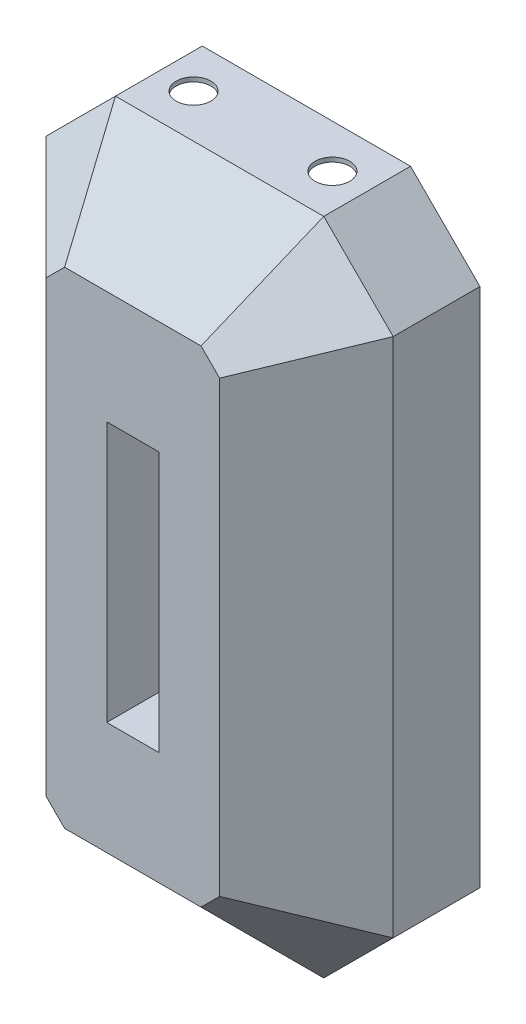
ISO-10303-21;
HEADER;
FILE_DESCRIPTION(('STEP AP214'),'2;1');
FILE_NAME('part.step','',(''),(''),'','','');
FILE_SCHEMA(('AUTOMOTIVE_DESIGN { 1 0 10303 214 1 1 1 1 }'));
ENDSEC;
DATA;
#1=APPLICATION_CONTEXT('core data for automotive mechanical design processes');
#2=APPLICATION_PROTOCOL_DEFINITION('international standard','automotive_design',2000,#1);
#3=PRODUCT_CONTEXT('',#1,'mechanical');
#4=PRODUCT('Part','Part','',(#3));
#5=PRODUCT_RELATED_PRODUCT_CATEGORY('part','',(#4));
#6=PRODUCT_DEFINITION_FORMATION('','',#4);
#7=PRODUCT_DEFINITION_CONTEXT('part definition',#1,'design');
#8=PRODUCT_DEFINITION('design','',#6,#7);
#9=PRODUCT_DEFINITION_SHAPE('','',#8);
#10=(LENGTH_UNIT() NAMED_UNIT(*) SI_UNIT(.MILLI.,.METRE.));
#11=(NAMED_UNIT(*) PLANE_ANGLE_UNIT() SI_UNIT($,.RADIAN.));
#12=(NAMED_UNIT(*) SI_UNIT($,.STERADIAN.) SOLID_ANGLE_UNIT());
#13=UNCERTAINTY_MEASURE_WITH_UNIT(LENGTH_MEASURE(1.E-05),#10,'distance_accuracy_value','');
#14=(GEOMETRIC_REPRESENTATION_CONTEXT(3) GLOBAL_UNCERTAINTY_ASSIGNED_CONTEXT((#13)) GLOBAL_UNIT_ASSIGNED_CONTEXT((#10,
#11,#12)) REPRESENTATION_CONTEXT('',''));
#15=CARTESIAN_POINT('',(0.,0.,0.));
#16=DIRECTION('',(0.,0.,1.));
#17=DIRECTION('',(1.,0.,0.));
#18=AXIS2_PLACEMENT_3D('',#15,#16,#17);
#19=CARTESIAN_POINT('',(0.,0.,254.));
#20=DIRECTION('',(0.,0.,-1.));
#21=DIRECTION('',(-1.,0.,0.));
#22=AXIS2_PLACEMENT_3D('',#19,#20,#21);
#23=PLANE('',#22);
#24=DIRECTION('',(-1.,0.,0.));
#25=VECTOR('',#24,1.);
#26=CARTESIAN_POINT('',(-38.1,190.5,254.));
#27=LINE('',#26,#25);
#28=CARTESIAN_POINT('',(38.1,190.5,254.));
#29=VERTEX_POINT('',#28);
#30=CARTESIAN_POINT('',(-38.1,190.5,254.));
#31=VERTEX_POINT('',#30);
#32=EDGE_CURVE('E218',#29,#31,#27,.T.);
#33=ORIENTED_EDGE('',*,*,#32,.F.);
#34=DIRECTION('',(0.,1.,0.));
#35=VECTOR('',#34,1.);
#36=CARTESIAN_POINT('',(38.1,190.5,254.));
#37=LINE('',#36,#35);
#38=CARTESIAN_POINT('',(38.1,-190.5,254.));
#39=VERTEX_POINT('',#38);
#40=EDGE_CURVE('E132',#39,#29,#37,.T.);
#41=ORIENTED_EDGE('',*,*,#40,.F.);
#42=DIRECTION('',(1.,0.,0.));
#43=VECTOR('',#42,1.);
#44=CARTESIAN_POINT('',(-38.1,-190.5,254.));
#45=LINE('',#44,#43);
#46=CARTESIAN_POINT('',(-38.1,-190.5,254.));
#47=VERTEX_POINT('',#46);
#48=EDGE_CURVE('E225',#47,#39,#45,.T.);
#49=ORIENTED_EDGE('',*,*,#48,.F.);
#50=DIRECTION('',(0.,-1.,0.));
#51=VECTOR('',#50,1.);
#52=CARTESIAN_POINT('',(-38.1,190.5,254.));
#53=LINE('',#52,#51);
#54=EDGE_CURVE('E208',#31,#47,#53,.T.);
#55=ORIENTED_EDGE('',*,*,#54,.F.);
#56=EDGE_LOOP('',(#33,#41,#49,#55));
#57=FACE_BOUND('',#56,.T.);
#58=DIRECTION('',(-0.707106781186548,-0.707106781186548,0.));
#59=VECTOR('',#58,1.);
#60=CARTESIAN_POINT('',(127.,-328.394877578617,254.));
#61=LINE('',#60,#59);
#62=CARTESIAN_POINT('',(127.,-328.394877578617,254.));
#63=VERTEX_POINT('',#62);
#64=CARTESIAN_POINT('',(99.794877578617,-355.6,254.));
#65=VERTEX_POINT('',#64);
#66=EDGE_CURVE('E558',#63,#65,#61,.T.);
#67=ORIENTED_EDGE('',*,*,#66,.F.);
#68=DIRECTION('',(0.,-1.,0.));
#69=VECTOR('',#68,1.);
#70=CARTESIAN_POINT('',(127.,328.394877578617,254.));
#71=LINE('',#70,#69);
#72=CARTESIAN_POINT('',(127.,328.394877578617,254.));
#73=VERTEX_POINT('',#72);
#74=EDGE_CURVE('E461',#73,#63,#71,.T.);
#75=ORIENTED_EDGE('',*,*,#74,.F.);
#76=DIRECTION('',(0.707106781186547,-0.707106781186548,0.));
#77=VECTOR('',#76,1.);
#78=CARTESIAN_POINT('',(99.7948775786169,355.6,254.));
#79=LINE('',#78,#77);
#80=CARTESIAN_POINT('',(99.7948775786169,355.6,254.));
#81=VERTEX_POINT('',#80);
#82=EDGE_CURVE('E286',#81,#73,#79,.T.);
#83=ORIENTED_EDGE('',*,*,#82,.F.);
#84=DIRECTION('',(1.,0.,0.));
#85=VECTOR('',#84,1.);
#86=CARTESIAN_POINT('',(-99.794877578617,355.6,254.));
#87=LINE('',#86,#85);
#88=CARTESIAN_POINT('',(-99.794877578617,355.6,254.));
#89=VERTEX_POINT('',#88);
#90=EDGE_CURVE('E300',#89,#81,#87,.T.);
#91=ORIENTED_EDGE('',*,*,#90,.F.);
#92=DIRECTION('',(0.707106781186548,0.707106781186548,0.));
#93=VECTOR('',#92,1.);
#94=CARTESIAN_POINT('',(-127.,328.394877578617,254.));
#95=LINE('',#94,#93);
#96=CARTESIAN_POINT('',(-127.,328.394877578617,254.));
#97=VERTEX_POINT('',#96);
#98=EDGE_CURVE('E585',#97,#89,#95,.T.);
#99=ORIENTED_EDGE('',*,*,#98,.F.);
#100=DIRECTION('',(0.,1.,0.));
#101=VECTOR('',#100,1.);
#102=CARTESIAN_POINT('',(-127.,-328.394877578617,254.));
#103=LINE('',#102,#101);
#104=CARTESIAN_POINT('',(-127.,-328.394877578617,254.));
#105=VERTEX_POINT('',#104);
#106=EDGE_CURVE('E562',#105,#97,#103,.T.);
#107=ORIENTED_EDGE('',*,*,#106,.F.);
#108=DIRECTION('',(-0.707106781186547,0.707106781186548,0.));
#109=VECTOR('',#108,1.);
#110=CARTESIAN_POINT('',(-99.7948775786169,-355.6,254.));
#111=LINE('',#110,#109);
#112=CARTESIAN_POINT('',(-99.7948775786169,-355.6,254.));
#113=VERTEX_POINT('',#112);
#114=EDGE_CURVE('E391',#113,#105,#111,.T.);
#115=ORIENTED_EDGE('',*,*,#114,.F.);
#116=DIRECTION('',(-1.,0.,0.));
#117=VECTOR('',#116,1.);
#118=CARTESIAN_POINT('',(99.794877578617,-355.6,254.));
#119=LINE('',#118,#117);
#120=EDGE_CURVE('E555',#65,#113,#119,.T.);
#121=ORIENTED_EDGE('',*,*,#120,.F.);
#122=EDGE_LOOP('',(#67,#75,#83,#91,#99,#107,#115,#121));
#123=FACE_BOUND('',#122,.T.);
#124=ADVANCED_FACE('F116',(#57,#123),#23,.F.);
#125=CARTESIAN_POINT('',(0.,0.,127.));
#126=DIRECTION('',(0.,0.,-1.));
#127=DIRECTION('',(-1.,0.,0.));
#128=AXIS2_PLACEMENT_3D('',#125,#126,#127);
#129=PLANE('',#128);
#130=DIRECTION('',(0.,-1.,0.));
#131=VECTOR('',#130,1.);
#132=CARTESIAN_POINT('',(38.1,0.,127.));
#133=LINE('',#132,#131);
#134=CARTESIAN_POINT('',(38.1,190.5,127.));
#135=VERTEX_POINT('',#134);
#136=CARTESIAN_POINT('',(38.1,-190.5,127.));
#137=VERTEX_POINT('',#136);
#138=EDGE_CURVE('E13',#135,#137,#133,.T.);
#139=ORIENTED_EDGE('',*,*,#138,.F.);
#140=DIRECTION('',(1.,0.,0.));
#141=VECTOR('',#140,1.);
#142=CARTESIAN_POINT('',(0.,190.5,127.));
#143=LINE('',#142,#141);
#144=CARTESIAN_POINT('',(-38.1,190.5,127.));
#145=VERTEX_POINT('',#144);
#146=EDGE_CURVE('E618',#145,#135,#143,.T.);
#147=ORIENTED_EDGE('',*,*,#146,.F.);
#148=DIRECTION('',(0.,1.,0.));
#149=VECTOR('',#148,1.);
#150=CARTESIAN_POINT('',(-38.1,0.,127.));
#151=LINE('',#150,#149);
#152=CARTESIAN_POINT('',(-38.1,-190.5,127.));
#153=VERTEX_POINT('',#152);
#154=EDGE_CURVE('E211',#153,#145,#151,.T.);
#155=ORIENTED_EDGE('',*,*,#154,.F.);
#156=DIRECTION('',(-1.,0.,0.));
#157=VECTOR('',#156,1.);
#158=CARTESIAN_POINT('',(0.,-190.5,127.));
#159=LINE('',#158,#157);
#160=EDGE_CURVE('E125',#137,#153,#159,.T.);
#161=ORIENTED_EDGE('',*,*,#160,.F.);
#162=EDGE_LOOP('',(#139,#147,#155,#161));
#163=FACE_BOUND('',#162,.T.);
#164=DIRECTION('',(-0.707106781186548,-0.707106781186547,0.));
#165=VECTOR('',#164,1.);
#166=CARTESIAN_POINT('',(254.,-381.,127.));
#167=LINE('',#166,#165);
#168=CARTESIAN_POINT('',(254.,-381.,127.));
#169=VERTEX_POINT('',#168);
#170=CARTESIAN_POINT('',(152.4,-482.6,127.));
#171=VERTEX_POINT('',#170);
#172=EDGE_CURVE('E235',#169,#171,#167,.T.);
#173=ORIENTED_EDGE('',*,*,#172,.T.);
#174=DIRECTION('',(-1.,0.,0.));
#175=VECTOR('',#174,1.);
#176=CARTESIAN_POINT('',(152.4,-482.6,127.));
#177=LINE('',#176,#175);
#178=CARTESIAN_POINT('',(-152.4,-482.6,127.));
#179=VERTEX_POINT('',#178);
#180=EDGE_CURVE('E432',#171,#179,#177,.T.);
#181=ORIENTED_EDGE('',*,*,#180,.T.);
#182=DIRECTION('',(-0.707106781186548,0.707106781186547,0.));
#183=VECTOR('',#182,1.);
#184=CARTESIAN_POINT('',(-152.4,-482.6,127.));
#185=LINE('',#184,#183);
#186=CARTESIAN_POINT('',(-254.,-381.,127.));
#187=VERTEX_POINT('',#186);
#188=EDGE_CURVE('E548',#179,#187,#185,.T.);
#189=ORIENTED_EDGE('',*,*,#188,.T.);
#190=DIRECTION('',(0.,1.,0.));
#191=VECTOR('',#190,1.);
#192=CARTESIAN_POINT('',(-254.,-381.,127.));
#193=LINE('',#192,#191);
#194=CARTESIAN_POINT('',(-254.,381.,127.));
#195=VERTEX_POINT('',#194);
#196=EDGE_CURVE('E360',#187,#195,#193,.T.);
#197=ORIENTED_EDGE('',*,*,#196,.T.);
#198=DIRECTION('',(0.707106781186548,0.707106781186547,0.));
#199=VECTOR('',#198,1.);
#200=CARTESIAN_POINT('',(-254.,381.,127.));
#201=LINE('',#200,#199);
#202=CARTESIAN_POINT('',(-152.4,482.6,127.));
#203=VERTEX_POINT('',#202);
#204=EDGE_CURVE('E341',#195,#203,#201,.T.);
#205=ORIENTED_EDGE('',*,*,#204,.T.);
#206=DIRECTION('',(1.,0.,0.));
#207=VECTOR('',#206,1.);
#208=CARTESIAN_POINT('',(-152.4,482.6,127.));
#209=LINE('',#208,#207);
#210=CARTESIAN_POINT('',(152.4,482.6,127.));
#211=VERTEX_POINT('',#210);
#212=EDGE_CURVE('E483',#203,#211,#209,.T.);
#213=ORIENTED_EDGE('',*,*,#212,.T.);
#214=DIRECTION('',(0.707106781186547,-0.707106781186548,0.));
#215=VECTOR('',#214,1.);
#216=CARTESIAN_POINT('',(152.4,482.6,127.));
#217=LINE('',#216,#215);
#218=CARTESIAN_POINT('',(254.,381.,127.));
#219=VERTEX_POINT('',#218);
#220=EDGE_CURVE('E471',#211,#219,#217,.T.);
#221=ORIENTED_EDGE('',*,*,#220,.T.);
#222=DIRECTION('',(0.,-1.,0.));
#223=VECTOR('',#222,1.);
#224=CARTESIAN_POINT('',(254.,381.,127.));
#225=LINE('',#224,#223);
#226=EDGE_CURVE('E245',#219,#169,#225,.T.);
#227=ORIENTED_EDGE('',*,*,#226,.T.);
#228=EDGE_LOOP('',(#173,#181,#189,#197,#205,#213,#221,#227));
#229=FACE_BOUND('',#228,.T.);
#230=ADVANCED_FACE('F485',(#163,#229),#129,.T.);
#231=CARTESIAN_POINT('',(0.,-304.8,304.8));
#232=DIRECTION('',(0.,-0.707106781186548,0.707106781186548));
#233=DIRECTION('',(0.,-0.707106781186548,-0.707106781186548));
#234=AXIS2_PLACEMENT_3D('',#231,#232,#233);
#235=PLANE('',#234);
#236=DIRECTION('',(-0.28108463771482,0.678598344545847,0.678598344545847));
#237=VECTOR('',#236,1.);
#238=CARTESIAN_POINT('',(152.4,-482.6,127.));
#239=LINE('',#238,#237);
#240=EDGE_CURVE('E424',#171,#65,#239,.T.);
#241=ORIENTED_EDGE('',*,*,#240,.T.);
#242=ORIENTED_EDGE('',*,*,#120,.T.);
#243=DIRECTION('',(0.28108463771482,0.678598344545847,0.678598344545847));
#244=VECTOR('',#243,1.);
#245=CARTESIAN_POINT('',(-152.4,-482.6,127.));
#246=LINE('',#245,#244);
#247=EDGE_CURVE('E415',#179,#113,#246,.T.);
#248=ORIENTED_EDGE('',*,*,#247,.F.);
#249=ORIENTED_EDGE('',*,*,#180,.F.);
#250=EDGE_LOOP('',(#241,#242,#248,#249));
#251=FACE_BOUND('',#250,.T.);
#252=ADVANCED_FACE('F406',(#251),#235,.T.);
#253=CARTESIAN_POINT('',(-203.651280605346,-203.651280605346,288.006403026729));
#254=DIRECTION('',(-0.5,-0.5,0.707106781186548));
#255=DIRECTION('',(0.816496580927726,0.,0.577350269189626));
#256=AXIS2_PLACEMENT_3D('',#253,#254,#255);
#257=PLANE('',#256);
#258=ORIENTED_EDGE('',*,*,#247,.T.);
#259=ORIENTED_EDGE('',*,*,#114,.T.);
#260=DIRECTION('',(0.678598344545847,0.28108463771482,0.678598344545847));
#261=VECTOR('',#260,1.);
#262=CARTESIAN_POINT('',(-254.,-381.,127.));
#263=LINE('',#262,#261);
#264=EDGE_CURVE('E353',#187,#105,#263,.T.);
#265=ORIENTED_EDGE('',*,*,#264,.F.);
#266=ORIENTED_EDGE('',*,*,#188,.F.);
#267=EDGE_LOOP('',(#258,#259,#265,#266));
#268=FACE_BOUND('',#267,.T.);
#269=ADVANCED_FACE('F397',(#268),#257,.T.);
#270=CARTESIAN_POINT('',(203.651280605346,-203.651280605346,288.006403026729));
#271=DIRECTION('',(0.5,-0.5,0.707106781186547));
#272=DIRECTION('',(0.816496580927726,0.,-0.577350269189626));
#273=AXIS2_PLACEMENT_3D('',#270,#271,#272);
#274=PLANE('',#273);
#275=DIRECTION('',(-0.678598344545847,0.281084637714819,0.678598344545847));
#276=VECTOR('',#275,1.);
#277=CARTESIAN_POINT('',(254.,-381.,127.));
#278=LINE('',#277,#276);
#279=EDGE_CURVE('E423',#169,#63,#278,.T.);
#280=ORIENTED_EDGE('',*,*,#279,.T.);
#281=ORIENTED_EDGE('',*,*,#66,.T.);
#282=ORIENTED_EDGE('',*,*,#240,.F.);
#283=ORIENTED_EDGE('',*,*,#172,.F.);
#284=EDGE_LOOP('',(#280,#281,#282,#283));
#285=FACE_BOUND('',#284,.T.);
#286=ADVANCED_FACE('F264',(#285),#274,.T.);
#287=CARTESIAN_POINT('',(190.5,0.,190.5));
#288=DIRECTION('',(0.707106781186547,0.,0.707106781186547));
#289=DIRECTION('',(0.707106781186548,0.,-0.707106781186548));
#290=AXIS2_PLACEMENT_3D('',#287,#288,#289);
#291=PLANE('',#290);
#292=DIRECTION('',(-0.678598344545847,-0.28108463771482,0.678598344545847));
#293=VECTOR('',#292,1.);
#294=CARTESIAN_POINT('',(254.,381.,127.));
#295=LINE('',#294,#293);
#296=EDGE_CURVE('E251',#219,#73,#295,.T.);
#297=ORIENTED_EDGE('',*,*,#296,.T.);
#298=ORIENTED_EDGE('',*,*,#74,.T.);
#299=ORIENTED_EDGE('',*,*,#279,.F.);
#300=ORIENTED_EDGE('',*,*,#226,.F.);
#301=EDGE_LOOP('',(#297,#298,#299,#300));
#302=FACE_BOUND('',#301,.T.);
#303=ADVANCED_FACE('F253',(#302),#291,.T.);
#304=CARTESIAN_POINT('',(203.651280605346,203.651280605346,288.006403026729));
#305=DIRECTION('',(0.5,0.5,0.707106781186547));
#306=DIRECTION('',(0.816496580927726,0.,-0.577350269189626));
#307=AXIS2_PLACEMENT_3D('',#304,#305,#306);
#308=PLANE('',#307);
#309=DIRECTION('',(-0.28108463771482,-0.678598344545847,0.678598344545847));
#310=VECTOR('',#309,1.);
#311=CARTESIAN_POINT('',(152.4,482.6,127.));
#312=LINE('',#311,#310);
#313=EDGE_CURVE('E333',#211,#81,#312,.T.);
#314=ORIENTED_EDGE('',*,*,#313,.T.);
#315=ORIENTED_EDGE('',*,*,#82,.T.);
#316=ORIENTED_EDGE('',*,*,#296,.F.);
#317=ORIENTED_EDGE('',*,*,#220,.F.);
#318=EDGE_LOOP('',(#314,#315,#316,#317));
#319=FACE_BOUND('',#318,.T.);
#320=ADVANCED_FACE('F263',(#319),#308,.T.);
#321=CARTESIAN_POINT('',(0.,304.8,304.8));
#322=DIRECTION('',(0.,0.707106781186548,0.707106781186548));
#323=DIRECTION('',(0.,-0.707106781186548,0.707106781186548));
#324=AXIS2_PLACEMENT_3D('',#321,#322,#323);
#325=PLANE('',#324);
#326=DIRECTION('',(0.28108463771482,-0.678598344545847,0.678598344545847));
#327=VECTOR('',#326,1.);
#328=CARTESIAN_POINT('',(-152.4,482.6,127.));
#329=LINE('',#328,#327);
#330=EDGE_CURVE('E324',#203,#89,#329,.T.);
#331=ORIENTED_EDGE('',*,*,#330,.T.);
#332=ORIENTED_EDGE('',*,*,#90,.T.);
#333=ORIENTED_EDGE('',*,*,#313,.F.);
#334=ORIENTED_EDGE('',*,*,#212,.F.);
#335=EDGE_LOOP('',(#331,#332,#333,#334));
#336=FACE_BOUND('',#335,.T.);
#337=ADVANCED_FACE('F306',(#336),#325,.T.);
#338=CARTESIAN_POINT('',(-203.651280605346,203.651280605346,288.006403026729));
#339=DIRECTION('',(-0.5,0.5,0.707106781186548));
#340=DIRECTION('',(0.816496580927726,0.,0.577350269189626));
#341=AXIS2_PLACEMENT_3D('',#338,#339,#340);
#342=PLANE('',#341);
#343=DIRECTION('',(0.678598344545848,-0.281084637714819,0.678598344545847));
#344=VECTOR('',#343,1.);
#345=CARTESIAN_POINT('',(-254.,381.,127.));
#346=LINE('',#345,#344);
#347=EDGE_CURVE('E332',#195,#97,#346,.T.);
#348=ORIENTED_EDGE('',*,*,#347,.T.);
#349=ORIENTED_EDGE('',*,*,#98,.T.);
#350=ORIENTED_EDGE('',*,*,#330,.F.);
#351=ORIENTED_EDGE('',*,*,#204,.F.);
#352=EDGE_LOOP('',(#348,#349,#350,#351));
#353=FACE_BOUND('',#352,.T.);
#354=ADVANCED_FACE('F315',(#353),#342,.T.);
#355=CARTESIAN_POINT('',(-190.5,0.,190.5));
#356=DIRECTION('',(-0.707106781186548,0.,0.707106781186548));
#357=DIRECTION('',(0.707106781186548,0.,0.707106781186548));
#358=AXIS2_PLACEMENT_3D('',#355,#356,#357);
#359=PLANE('',#358);
#360=ORIENTED_EDGE('',*,*,#264,.T.);
#361=ORIENTED_EDGE('',*,*,#106,.T.);
#362=ORIENTED_EDGE('',*,*,#347,.F.);
#363=ORIENTED_EDGE('',*,*,#196,.F.);
#364=EDGE_LOOP('',(#360,#361,#362,#363));
#365=FACE_BOUND('',#364,.T.);
#366=ADVANCED_FACE('F366',(#365),#359,.T.);
#367=CARTESIAN_POINT('',(38.1,190.5,0.));
#368=DIRECTION('',(1.,0.,0.));
#369=DIRECTION('',(0.,1.,0.));
#370=AXIS2_PLACEMENT_3D('',#367,#368,#369);
#371=PLANE('',#370);
#372=ORIENTED_EDGE('',*,*,#138,.T.);
#373=DIRECTION('',(0.,0.,1.));
#374=VECTOR('',#373,1.);
#375=CARTESIAN_POINT('',(38.1,-190.5,0.));
#376=LINE('',#375,#374);
#377=EDGE_CURVE('E232',#137,#39,#376,.T.);
#378=ORIENTED_EDGE('',*,*,#377,.T.);
#379=ORIENTED_EDGE('',*,*,#40,.T.);
#380=DIRECTION('',(0.,0.,1.));
#381=VECTOR('',#380,1.);
#382=CARTESIAN_POINT('',(38.1,190.5,0.));
#383=LINE('',#382,#381);
#384=EDGE_CURVE('E215',#135,#29,#383,.T.);
#385=ORIENTED_EDGE('',*,*,#384,.F.);
#386=EDGE_LOOP('',(#372,#378,#379,#385));
#387=FACE_BOUND('',#386,.T.);
#388=ADVANCED_FACE('F374',(#387),#371,.F.);
#389=CARTESIAN_POINT('',(-38.1,-190.5,0.));
#390=DIRECTION('',(0.,-1.,0.));
#391=DIRECTION('',(0.,0.,-1.));
#392=AXIS2_PLACEMENT_3D('',#389,#390,#391);
#393=PLANE('',#392);
#394=ORIENTED_EDGE('',*,*,#160,.T.);
#395=DIRECTION('',(0.,0.,1.));
#396=VECTOR('',#395,1.);
#397=CARTESIAN_POINT('',(-38.1,-190.5,0.));
#398=LINE('',#397,#396);
#399=EDGE_CURVE('E214',#153,#47,#398,.T.);
#400=ORIENTED_EDGE('',*,*,#399,.T.);
#401=ORIENTED_EDGE('',*,*,#48,.T.);
#402=ORIENTED_EDGE('',*,*,#377,.F.);
#403=EDGE_LOOP('',(#394,#400,#401,#402));
#404=FACE_BOUND('',#403,.T.);
#405=ADVANCED_FACE('F675',(#404),#393,.F.);
#406=CARTESIAN_POINT('',(-38.1,190.5,0.));
#407=DIRECTION('',(-1.,0.,0.));
#408=DIRECTION('',(0.,-1.,0.));
#409=AXIS2_PLACEMENT_3D('',#406,#407,#408);
#410=PLANE('',#409);
#411=ORIENTED_EDGE('',*,*,#154,.T.);
#412=DIRECTION('',(0.,0.,1.));
#413=VECTOR('',#412,1.);
#414=CARTESIAN_POINT('',(-38.1,190.5,0.));
#415=LINE('',#414,#413);
#416=EDGE_CURVE('E140',#145,#31,#415,.T.);
#417=ORIENTED_EDGE('',*,*,#416,.T.);
#418=ORIENTED_EDGE('',*,*,#54,.T.);
#419=ORIENTED_EDGE('',*,*,#399,.F.);
#420=EDGE_LOOP('',(#411,#417,#418,#419));
#421=FACE_BOUND('',#420,.T.);
#422=ADVANCED_FACE('F205',(#421),#410,.F.);
#423=CARTESIAN_POINT('',(-38.1,190.5,0.));
#424=DIRECTION('',(0.,1.,0.));
#425=DIRECTION('',(0.,0.,1.));
#426=AXIS2_PLACEMENT_3D('',#423,#424,#425);
#427=PLANE('',#426);
#428=ORIENTED_EDGE('',*,*,#146,.T.);
#429=ORIENTED_EDGE('',*,*,#384,.T.);
#430=ORIENTED_EDGE('',*,*,#32,.T.);
#431=ORIENTED_EDGE('',*,*,#416,.F.);
#432=EDGE_LOOP('',(#428,#429,#430,#431));
#433=FACE_BOUND('',#432,.T.);
#434=ADVANCED_FACE('F219',(#433),#427,.F.);
#435=CLOSED_SHELL('',(#124,#230,#252,#269,#286,#303,#320,#337,#354,#366,#388,#405,#422,#434));
#436=MANIFOLD_SOLID_BREP('B2',#435);
#437=CARTESIAN_POINT('',(-152.4,482.6,127.));
#438=DIRECTION('',(0.,1.,0.));
#439=DIRECTION('',(0.,0.,1.));
#440=AXIS2_PLACEMENT_3D('',#437,#438,#439);
#441=PLANE('',#440);
#442=CARTESIAN_POINT('',(101.6,482.6,63.5));
#443=DIRECTION('',(0.,1.,0.));
#444=DIRECTION('',(0.,0.,1.));
#445=AXIS2_PLACEMENT_3D('',#442,#443,#444);
#446=CIRCLE('',#445,25.4);
#447=CARTESIAN_POINT('',(101.6,482.6,88.9));
#448=VERTEX_POINT('',#447);
#449=EDGE_CURVE('E1172',#448,#448,#446,.T.);
#450=ORIENTED_EDGE('',*,*,#449,.F.);
#451=EDGE_LOOP('',(#450));
#452=FACE_BOUND('',#451,.T.);
#453=CARTESIAN_POINT('',(-101.6,482.6,63.5));
#454=DIRECTION('',(0.,1.,0.));
#455=DIRECTION('',(0.,0.,1.));
#456=AXIS2_PLACEMENT_3D('',#453,#454,#455);
#457=CIRCLE('',#456,25.4);
#458=CARTESIAN_POINT('',(-101.6,482.6,88.9));
#459=VERTEX_POINT('',#458);
#460=EDGE_CURVE('E1018',#459,#459,#457,.T.);
#461=ORIENTED_EDGE('',*,*,#460,.F.);
#462=EDGE_LOOP('',(#461));
#463=FACE_BOUND('',#462,.T.);
#464=DIRECTION('',(1.,0.,0.));
#465=VECTOR('',#464,1.);
#466=CARTESIAN_POINT('',(-152.4,482.6,0.));
#467=LINE('',#466,#465);
#468=CARTESIAN_POINT('',(-152.4,482.6,0.));
#469=VERTEX_POINT('',#468);
#470=CARTESIAN_POINT('',(152.4,482.6,0.));
#471=VERTEX_POINT('',#470);
#472=EDGE_CURVE('E1052',#469,#471,#467,.T.);
#473=ORIENTED_EDGE('',*,*,#472,.F.);
#474=DIRECTION('',(0.,0.,-1.));
#475=VECTOR('',#474,1.);
#476=CARTESIAN_POINT('',(-152.4,482.6,127.));
#477=LINE('',#476,#475);
#478=CARTESIAN_POINT('',(-152.4,482.6,127.));
#479=VERTEX_POINT('',#478);
#480=EDGE_CURVE('E114',#479,#469,#477,.T.);
#481=ORIENTED_EDGE('',*,*,#480,.F.);
#482=DIRECTION('',(1.,0.,0.));
#483=VECTOR('',#482,1.);
#484=CARTESIAN_POINT('',(-152.4,482.6,127.));
#485=LINE('',#484,#483);
#486=CARTESIAN_POINT('',(152.4,482.6,127.));
#487=VERTEX_POINT('',#486);
#488=EDGE_CURVE('E1064',#479,#487,#485,.T.);
#489=ORIENTED_EDGE('',*,*,#488,.T.);
#490=DIRECTION('',(0.,0.,-1.));
#491=VECTOR('',#490,1.);
#492=CARTESIAN_POINT('',(152.4,482.6,127.));
#493=LINE('',#492,#491);
#494=EDGE_CURVE('E884',#487,#471,#493,.T.);
#495=ORIENTED_EDGE('',*,*,#494,.T.);
#496=EDGE_LOOP('',(#473,#481,#489,#495));
#497=FACE_BOUND('',#496,.T.);
#498=ADVANCED_FACE('F881',(#452,#463,#497),#441,.T.);
#499=CARTESIAN_POINT('',(-152.4,482.6,127.));
#500=DIRECTION('',(0.707106781186547,-0.707106781186548,0.));
#501=DIRECTION('',(0.707106781186548,0.707106781186547,0.));
#502=AXIS2_PLACEMENT_3D('',#499,#500,#501);
#503=PLANE('',#502);
#504=DIRECTION('',(-0.707106781186548,-0.707106781186547,0.));
#505=VECTOR('',#504,1.);
#506=CARTESIAN_POINT('',(-152.4,482.6,0.));
#507=LINE('',#506,#505);
#508=CARTESIAN_POINT('',(-254.,381.,0.));
#509=VERTEX_POINT('',#508);
#510=EDGE_CURVE('E1068',#469,#509,#507,.T.);
#511=ORIENTED_EDGE('',*,*,#510,.T.);
#512=DIRECTION('',(0.,0.,-1.));
#513=VECTOR('',#512,1.);
#514=CARTESIAN_POINT('',(-254.,381.,127.));
#515=LINE('',#514,#513);
#516=CARTESIAN_POINT('',(-254.,381.,127.));
#517=VERTEX_POINT('',#516);
#518=EDGE_CURVE('E889',#517,#509,#515,.T.);
#519=ORIENTED_EDGE('',*,*,#518,.F.);
#520=DIRECTION('',(-0.707106781186548,-0.707106781186547,0.));
#521=VECTOR('',#520,1.);
#522=CARTESIAN_POINT('',(-152.4,482.6,127.));
#523=LINE('',#522,#521);
#524=EDGE_CURVE('E1083',#479,#517,#523,.T.);
#525=ORIENTED_EDGE('',*,*,#524,.F.);
#526=ORIENTED_EDGE('',*,*,#480,.T.);
#527=EDGE_LOOP('',(#511,#519,#525,#526));
#528=FACE_BOUND('',#527,.T.);
#529=ADVANCED_FACE('F1131',(#528),#503,.F.);
#530=CARTESIAN_POINT('',(-254.,381.,127.));
#531=DIRECTION('',(1.,0.,0.));
#532=DIRECTION('',(0.,1.,0.));
#533=AXIS2_PLACEMENT_3D('',#530,#531,#532);
#534=PLANE('',#533);
#535=DIRECTION('',(0.,-1.,0.));
#536=VECTOR('',#535,1.);
#537=CARTESIAN_POINT('',(-254.,381.,0.));
#538=LINE('',#537,#536);
#539=CARTESIAN_POINT('',(-254.,-381.,0.));
#540=VERTEX_POINT('',#539);
#541=EDGE_CURVE('E1101',#509,#540,#538,.T.);
#542=ORIENTED_EDGE('',*,*,#541,.T.);
#543=DIRECTION('',(0.,0.,-1.));
#544=VECTOR('',#543,1.);
#545=CARTESIAN_POINT('',(-254.,-381.,127.));
#546=LINE('',#545,#544);
#547=CARTESIAN_POINT('',(-254.,-381.,127.));
#548=VERTEX_POINT('',#547);
#549=EDGE_CURVE('E1106',#548,#540,#546,.T.);
#550=ORIENTED_EDGE('',*,*,#549,.F.);
#551=DIRECTION('',(0.,-1.,0.));
#552=VECTOR('',#551,1.);
#553=CARTESIAN_POINT('',(-254.,381.,127.));
#554=LINE('',#553,#552);
#555=EDGE_CURVE('E1081',#517,#548,#554,.T.);
#556=ORIENTED_EDGE('',*,*,#555,.F.);
#557=ORIENTED_EDGE('',*,*,#518,.T.);
#558=EDGE_LOOP('',(#542,#550,#556,#557));
#559=FACE_BOUND('',#558,.T.);
#560=ADVANCED_FACE('F1135',(#559),#534,.F.);
#561=CARTESIAN_POINT('',(-254.,-381.,127.));
#562=DIRECTION('',(0.707106781186547,0.707106781186548,0.));
#563=DIRECTION('',(-0.707106781186548,0.707106781186547,0.));
#564=AXIS2_PLACEMENT_3D('',#561,#562,#563);
#565=PLANE('',#564);
#566=DIRECTION('',(0.707106781186548,-0.707106781186547,0.));
#567=VECTOR('',#566,1.);
#568=CARTESIAN_POINT('',(-254.,-381.,0.));
#569=LINE('',#568,#567);
#570=CARTESIAN_POINT('',(-152.4,-482.6,0.));
#571=VERTEX_POINT('',#570);
#572=EDGE_CURVE('E1099',#540,#571,#569,.T.);
#573=ORIENTED_EDGE('',*,*,#572,.T.);
#574=DIRECTION('',(0.,0.,-1.));
#575=VECTOR('',#574,1.);
#576=CARTESIAN_POINT('',(-152.4,-482.6,127.));
#577=LINE('',#576,#575);
#578=CARTESIAN_POINT('',(-152.4,-482.6,127.));
#579=VERTEX_POINT('',#578);
#580=EDGE_CURVE('E1109',#579,#571,#577,.T.);
#581=ORIENTED_EDGE('',*,*,#580,.F.);
#582=DIRECTION('',(0.707106781186548,-0.707106781186547,0.));
#583=VECTOR('',#582,1.);
#584=CARTESIAN_POINT('',(-254.,-381.,127.));
#585=LINE('',#584,#583);
#586=EDGE_CURVE('E1079',#548,#579,#585,.T.);
#587=ORIENTED_EDGE('',*,*,#586,.F.);
#588=ORIENTED_EDGE('',*,*,#549,.T.);
#589=EDGE_LOOP('',(#573,#581,#587,#588));
#590=FACE_BOUND('',#589,.T.);
#591=ADVANCED_FACE('F1152',(#590),#565,.F.);
#592=CARTESIAN_POINT('',(-152.4,-482.6,127.));
#593=DIRECTION('',(0.,1.,0.));
#594=DIRECTION('',(0.,0.,1.));
#595=AXIS2_PLACEMENT_3D('',#592,#593,#594);
#596=PLANE('',#595);
#597=DIRECTION('',(1.,0.,0.));
#598=VECTOR('',#597,1.);
#599=CARTESIAN_POINT('',(-152.4,-482.6,0.));
#600=LINE('',#599,#598);
#601=CARTESIAN_POINT('',(152.4,-482.6,0.));
#602=VERTEX_POINT('',#601);
#603=EDGE_CURVE('E1096',#571,#602,#600,.T.);
#604=ORIENTED_EDGE('',*,*,#603,.T.);
#605=DIRECTION('',(0.,0.,-1.));
#606=VECTOR('',#605,1.);
#607=CARTESIAN_POINT('',(152.4,-482.6,127.));
#608=LINE('',#607,#606);
#609=CARTESIAN_POINT('',(152.4,-482.6,127.));
#610=VERTEX_POINT('',#609);
#611=EDGE_CURVE('E1112',#610,#602,#608,.T.);
#612=ORIENTED_EDGE('',*,*,#611,.F.);
#613=DIRECTION('',(1.,0.,0.));
#614=VECTOR('',#613,1.);
#615=CARTESIAN_POINT('',(-152.4,-482.6,127.));
#616=LINE('',#615,#614);
#617=EDGE_CURVE('E1077',#579,#610,#616,.T.);
#618=ORIENTED_EDGE('',*,*,#617,.F.);
#619=ORIENTED_EDGE('',*,*,#580,.T.);
#620=EDGE_LOOP('',(#604,#612,#618,#619));
#621=FACE_BOUND('',#620,.T.);
#622=ADVANCED_FACE('F1150',(#621),#596,.F.);
#623=CARTESIAN_POINT('',(254.,-381.,127.));
#624=DIRECTION('',(0.707106781186547,-0.707106781186548,0.));
#625=DIRECTION('',(0.707106781186548,0.707106781186547,0.));
#626=AXIS2_PLACEMENT_3D('',#623,#624,#625);
#627=PLANE('',#626);
#628=DIRECTION('',(-0.707106781186548,-0.707106781186547,0.));
#629=VECTOR('',#628,1.);
#630=CARTESIAN_POINT('',(254.,-381.,0.));
#631=LINE('',#630,#629);
#632=CARTESIAN_POINT('',(254.,-381.,0.));
#633=VERTEX_POINT('',#632);
#634=EDGE_CURVE('E1093',#633,#602,#631,.T.);
#635=ORIENTED_EDGE('',*,*,#634,.F.);
#636=DIRECTION('',(0.,0.,-1.));
#637=VECTOR('',#636,1.);
#638=CARTESIAN_POINT('',(254.,-381.,127.));
#639=LINE('',#638,#637);
#640=CARTESIAN_POINT('',(254.,-381.,127.));
#641=VERTEX_POINT('',#640);
#642=EDGE_CURVE('E1114',#641,#633,#639,.T.);
#643=ORIENTED_EDGE('',*,*,#642,.F.);
#644=DIRECTION('',(-0.707106781186548,-0.707106781186547,0.));
#645=VECTOR('',#644,1.);
#646=CARTESIAN_POINT('',(254.,-381.,127.));
#647=LINE('',#646,#645);
#648=EDGE_CURVE('E1074',#641,#610,#647,.T.);
#649=ORIENTED_EDGE('',*,*,#648,.T.);
#650=ORIENTED_EDGE('',*,*,#611,.T.);
#651=EDGE_LOOP('',(#635,#643,#649,#650));
#652=FACE_BOUND('',#651,.T.);
#653=ADVANCED_FACE('F1146',(#652),#627,.T.);
#654=CARTESIAN_POINT('',(254.,381.,127.));
#655=DIRECTION('',(1.,0.,0.));
#656=DIRECTION('',(0.,1.,0.));
#657=AXIS2_PLACEMENT_3D('',#654,#655,#656);
#658=PLANE('',#657);
#659=DIRECTION('',(0.,-1.,0.));
#660=VECTOR('',#659,1.);
#661=CARTESIAN_POINT('',(254.,381.,0.));
#662=LINE('',#661,#660);
#663=CARTESIAN_POINT('',(254.,381.,0.));
#664=VERTEX_POINT('',#663);
#665=EDGE_CURVE('E1090',#664,#633,#662,.T.);
#666=ORIENTED_EDGE('',*,*,#665,.F.);
#667=DIRECTION('',(0.,0.,-1.));
#668=VECTOR('',#667,1.);
#669=CARTESIAN_POINT('',(254.,381.,127.));
#670=LINE('',#669,#668);
#671=CARTESIAN_POINT('',(254.,381.,127.));
#672=VERTEX_POINT('',#671);
#673=EDGE_CURVE('E1115',#672,#664,#670,.T.);
#674=ORIENTED_EDGE('',*,*,#673,.F.);
#675=DIRECTION('',(0.,-1.,0.));
#676=VECTOR('',#675,1.);
#677=CARTESIAN_POINT('',(254.,381.,127.));
#678=LINE('',#677,#676);
#679=EDGE_CURVE('E1071',#672,#641,#678,.T.);
#680=ORIENTED_EDGE('',*,*,#679,.T.);
#681=ORIENTED_EDGE('',*,*,#642,.T.);
#682=EDGE_LOOP('',(#666,#674,#680,#681));
#683=FACE_BOUND('',#682,.T.);
#684=ADVANCED_FACE('F1142',(#683),#658,.T.);
#685=CARTESIAN_POINT('',(152.4,482.6,127.));
#686=DIRECTION('',(0.707106781186548,0.707106781186547,0.));
#687=DIRECTION('',(-0.707106781186547,0.707106781186548,0.));
#688=AXIS2_PLACEMENT_3D('',#685,#686,#687);
#689=PLANE('',#688);
#690=DIRECTION('',(0.707106781186547,-0.707106781186548,0.));
#691=VECTOR('',#690,1.);
#692=CARTESIAN_POINT('',(152.4,482.6,0.));
#693=LINE('',#692,#691);
#694=EDGE_CURVE('E1087',#471,#664,#693,.T.);
#695=ORIENTED_EDGE('',*,*,#694,.F.);
#696=ORIENTED_EDGE('',*,*,#494,.F.);
#697=DIRECTION('',(0.707106781186547,-0.707106781186548,0.));
#698=VECTOR('',#697,1.);
#699=CARTESIAN_POINT('',(152.4,482.6,127.));
#700=LINE('',#699,#698);
#701=EDGE_CURVE('E1067',#487,#672,#700,.T.);
#702=ORIENTED_EDGE('',*,*,#701,.T.);
#703=ORIENTED_EDGE('',*,*,#673,.T.);
#704=EDGE_LOOP('',(#695,#696,#702,#703));
#705=FACE_BOUND('',#704,.T.);
#706=ADVANCED_FACE('F1123',(#705),#689,.T.);
#707=CARTESIAN_POINT('',(0.,0.,127.));
#708=DIRECTION('',(0.,0.,-1.));
#709=DIRECTION('',(-1.,0.,0.));
#710=AXIS2_PLACEMENT_3D('',#707,#708,#709);
#711=PLANE('',#710);
#712=DIRECTION('',(-0.707106781186548,-0.707106781186547,0.));
#713=VECTOR('',#712,1.);
#714=CARTESIAN_POINT('',(-149.769743878931,476.25,127.));
#715=LINE('',#714,#713);
#716=CARTESIAN_POINT('',(-149.769743878931,476.25,127.));
#717=VERTEX_POINT('',#716);
#718=CARTESIAN_POINT('',(-247.65,378.369743878931,127.));
#719=VERTEX_POINT('',#718);
#720=EDGE_CURVE('E1002',#717,#719,#715,.T.);
#721=ORIENTED_EDGE('',*,*,#720,.F.);
#722=DIRECTION('',(1.,0.,0.));
#723=VECTOR('',#722,1.);
#724=CARTESIAN_POINT('',(-149.769743878931,476.25,127.));
#725=LINE('',#724,#723);
#726=CARTESIAN_POINT('',(149.769743878931,476.25,127.));
#727=VERTEX_POINT('',#726);
#728=EDGE_CURVE('E996',#717,#727,#725,.T.);
#729=ORIENTED_EDGE('',*,*,#728,.T.);
#730=DIRECTION('',(0.707106781186547,-0.707106781186548,0.));
#731=VECTOR('',#730,1.);
#732=CARTESIAN_POINT('',(149.769743878931,476.25,127.));
#733=LINE('',#732,#731);
#734=CARTESIAN_POINT('',(247.65,378.369743878931,127.));
#735=VERTEX_POINT('',#734);
#736=EDGE_CURVE('E1005',#727,#735,#733,.T.);
#737=ORIENTED_EDGE('',*,*,#736,.T.);
#738=DIRECTION('',(0.,-1.,0.));
#739=VECTOR('',#738,1.);
#740=CARTESIAN_POINT('',(247.65,378.369743878931,127.));
#741=LINE('',#740,#739);
#742=CARTESIAN_POINT('',(247.65,-378.369743878931,127.));
#743=VERTEX_POINT('',#742);
#744=EDGE_CURVE('E897',#735,#743,#741,.T.);
#745=ORIENTED_EDGE('',*,*,#744,.T.);
#746=DIRECTION('',(-0.707106781186547,-0.707106781186547,0.));
#747=VECTOR('',#746,1.);
#748=CARTESIAN_POINT('',(247.65,-378.369743878931,127.));
#749=LINE('',#748,#747);
#750=CARTESIAN_POINT('',(149.769743878931,-476.25,127.));
#751=VERTEX_POINT('',#750);
#752=EDGE_CURVE('E1022',#743,#751,#749,.T.);
#753=ORIENTED_EDGE('',*,*,#752,.T.);
#754=DIRECTION('',(1.,0.,0.));
#755=VECTOR('',#754,1.);
#756=CARTESIAN_POINT('',(-149.769743878931,-476.25,127.));
#757=LINE('',#756,#755);
#758=CARTESIAN_POINT('',(-149.769743878931,-476.25,127.));
#759=VERTEX_POINT('',#758);
#760=EDGE_CURVE('E1025',#759,#751,#757,.T.);
#761=ORIENTED_EDGE('',*,*,#760,.F.);
#762=DIRECTION('',(0.707106781186548,-0.707106781186547,0.));
#763=VECTOR('',#762,1.);
#764=CARTESIAN_POINT('',(-247.65,-378.369743878931,127.));
#765=LINE('',#764,#763);
#766=CARTESIAN_POINT('',(-247.65,-378.369743878931,127.));
#767=VERTEX_POINT('',#766);
#768=EDGE_CURVE('E1027',#767,#759,#765,.T.);
#769=ORIENTED_EDGE('',*,*,#768,.F.);
#770=DIRECTION('',(0.,-1.,0.));
#771=VECTOR('',#770,1.);
#772=CARTESIAN_POINT('',(-247.65,378.369743878931,127.));
#773=LINE('',#772,#771);
#774=EDGE_CURVE('E1029',#719,#767,#773,.T.);
#775=ORIENTED_EDGE('',*,*,#774,.F.);
#776=EDGE_LOOP('',(#721,#729,#737,#745,#753,#761,#769,#775));
#777=FACE_BOUND('',#776,.T.);
#778=ORIENTED_EDGE('',*,*,#488,.F.);
#779=ORIENTED_EDGE('',*,*,#524,.T.);
#780=ORIENTED_EDGE('',*,*,#555,.T.);
#781=ORIENTED_EDGE('',*,*,#586,.T.);
#782=ORIENTED_EDGE('',*,*,#617,.T.);
#783=ORIENTED_EDGE('',*,*,#648,.F.);
#784=ORIENTED_EDGE('',*,*,#679,.F.);
#785=ORIENTED_EDGE('',*,*,#701,.F.);
#786=EDGE_LOOP('',(#778,#779,#780,#781,#782,#783,#784,#785));
#787=FACE_BOUND('',#786,.T.);
#788=ADVANCED_FACE('F1009',(#777,#787),#711,.F.);
#789=CARTESIAN_POINT('',(0.,0.,0.));
#790=DIRECTION('',(0.,0.,-1.));
#791=DIRECTION('',(-1.,0.,0.));
#792=AXIS2_PLACEMENT_3D('',#789,#790,#791);
#793=PLANE('',#792);
#794=DIRECTION('',(1.,0.,0.));
#795=VECTOR('',#794,1.);
#796=CARTESIAN_POINT('',(-149.769743878931,476.25,0.));
#797=LINE('',#796,#795);
#798=CARTESIAN_POINT('',(-149.769743878931,476.25,0.));
#799=VERTEX_POINT('',#798);
#800=CARTESIAN_POINT('',(149.769743878931,476.25,0.));
#801=VERTEX_POINT('',#800);
#802=EDGE_CURVE('E905',#799,#801,#797,.T.);
#803=ORIENTED_EDGE('',*,*,#802,.F.);
#804=DIRECTION('',(-0.707106781186548,-0.707106781186547,0.));
#805=VECTOR('',#804,1.);
#806=CARTESIAN_POINT('',(-149.769743878931,476.25,0.));
#807=LINE('',#806,#805);
#808=CARTESIAN_POINT('',(-247.65,378.369743878931,0.));
#809=VERTEX_POINT('',#808);
#810=EDGE_CURVE('E1012',#799,#809,#807,.T.);
#811=ORIENTED_EDGE('',*,*,#810,.T.);
#812=DIRECTION('',(0.,-1.,0.));
#813=VECTOR('',#812,1.);
#814=CARTESIAN_POINT('',(-247.65,378.369743878931,0.));
#815=LINE('',#814,#813);
#816=CARTESIAN_POINT('',(-247.65,-378.369743878931,0.));
#817=VERTEX_POINT('',#816);
#818=EDGE_CURVE('E1015',#809,#817,#815,.T.);
#819=ORIENTED_EDGE('',*,*,#818,.T.);
#820=DIRECTION('',(0.707106781186548,-0.707106781186547,0.));
#821=VECTOR('',#820,1.);
#822=CARTESIAN_POINT('',(-247.65,-378.369743878931,0.));
#823=LINE('',#822,#821);
#824=CARTESIAN_POINT('',(-149.769743878931,-476.25,0.));
#825=VERTEX_POINT('',#824);
#826=EDGE_CURVE('E1045',#817,#825,#823,.T.);
#827=ORIENTED_EDGE('',*,*,#826,.T.);
#828=DIRECTION('',(1.,0.,0.));
#829=VECTOR('',#828,1.);
#830=CARTESIAN_POINT('',(-149.769743878931,-476.25,0.));
#831=LINE('',#830,#829);
#832=CARTESIAN_POINT('',(149.769743878931,-476.25,0.));
#833=VERTEX_POINT('',#832);
#834=EDGE_CURVE('E1042',#825,#833,#831,.T.);
#835=ORIENTED_EDGE('',*,*,#834,.T.);
#836=DIRECTION('',(-0.707106781186547,-0.707106781186547,0.));
#837=VECTOR('',#836,1.);
#838=CARTESIAN_POINT('',(247.65,-378.369743878931,0.));
#839=LINE('',#838,#837);
#840=CARTESIAN_POINT('',(247.65,-378.369743878931,0.));
#841=VERTEX_POINT('',#840);
#842=EDGE_CURVE('E1039',#841,#833,#839,.T.);
#843=ORIENTED_EDGE('',*,*,#842,.F.);
#844=DIRECTION('',(0.,-1.,0.));
#845=VECTOR('',#844,1.);
#846=CARTESIAN_POINT('',(247.65,378.369743878931,0.));
#847=LINE('',#846,#845);
#848=CARTESIAN_POINT('',(247.65,378.369743878931,0.));
#849=VERTEX_POINT('',#848);
#850=EDGE_CURVE('E1036',#849,#841,#847,.T.);
#851=ORIENTED_EDGE('',*,*,#850,.F.);
#852=DIRECTION('',(0.707106781186547,-0.707106781186548,0.));
#853=VECTOR('',#852,1.);
#854=CARTESIAN_POINT('',(149.769743878931,476.25,0.));
#855=LINE('',#854,#853);
#856=EDGE_CURVE('E1033',#801,#849,#855,.T.);
#857=ORIENTED_EDGE('',*,*,#856,.F.);
#858=EDGE_LOOP('',(#803,#811,#819,#827,#835,#843,#851,#857));
#859=FACE_BOUND('',#858,.T.);
#860=ORIENTED_EDGE('',*,*,#472,.T.);
#861=ORIENTED_EDGE('',*,*,#694,.T.);
#862=ORIENTED_EDGE('',*,*,#665,.T.);
#863=ORIENTED_EDGE('',*,*,#634,.T.);
#864=ORIENTED_EDGE('',*,*,#603,.F.);
#865=ORIENTED_EDGE('',*,*,#572,.F.);
#866=ORIENTED_EDGE('',*,*,#541,.F.);
#867=ORIENTED_EDGE('',*,*,#510,.F.);
#868=EDGE_LOOP('',(#860,#861,#862,#863,#864,#865,#866,#867));
#869=FACE_BOUND('',#868,.T.);
#870=ADVANCED_FACE('F1126',(#859,#869),#793,.T.);
#871=CARTESIAN_POINT('',(-149.769743878931,476.25,127.));
#872=DIRECTION('',(0.,1.,0.));
#873=DIRECTION('',(0.,0.,1.));
#874=AXIS2_PLACEMENT_3D('',#871,#872,#873);
#875=PLANE('',#874);
#876=CARTESIAN_POINT('',(101.6,476.25,63.5));
#877=DIRECTION('',(0.,1.,0.));
#878=DIRECTION('',(0.,0.,1.));
#879=AXIS2_PLACEMENT_3D('',#876,#877,#878);
#880=CIRCLE('',#879,25.4);
#881=CARTESIAN_POINT('',(101.6,476.25,88.9));
#882=VERTEX_POINT('',#881);
#883=EDGE_CURVE('E1034',#882,#882,#880,.F.);
#884=ORIENTED_EDGE('',*,*,#883,.F.);
#885=EDGE_LOOP('',(#884));
#886=FACE_BOUND('',#885,.T.);
#887=CARTESIAN_POINT('',(-101.6,476.25,63.5));
#888=DIRECTION('',(0.,1.,0.));
#889=DIRECTION('',(0.,0.,1.));
#890=AXIS2_PLACEMENT_3D('',#887,#888,#889);
#891=CIRCLE('',#890,25.4);
#892=CARTESIAN_POINT('',(-101.6,476.25,88.9));
#893=VERTEX_POINT('',#892);
#894=EDGE_CURVE('E1176',#893,#893,#891,.F.);
#895=ORIENTED_EDGE('',*,*,#894,.F.);
#896=EDGE_LOOP('',(#895));
#897=FACE_BOUND('',#896,.T.);
#898=ORIENTED_EDGE('',*,*,#802,.T.);
#899=DIRECTION('',(0.,0.,-1.));
#900=VECTOR('',#899,1.);
#901=CARTESIAN_POINT('',(149.769743878931,476.25,127.));
#902=LINE('',#901,#900);
#903=EDGE_CURVE('E992',#727,#801,#902,.T.);
#904=ORIENTED_EDGE('',*,*,#903,.F.);
#905=ORIENTED_EDGE('',*,*,#728,.F.);
#906=DIRECTION('',(0.,0.,-1.));
#907=VECTOR('',#906,1.);
#908=CARTESIAN_POINT('',(-149.769743878931,476.25,127.));
#909=LINE('',#908,#907);
#910=EDGE_CURVE('E1050',#717,#799,#909,.T.);
#911=ORIENTED_EDGE('',*,*,#910,.T.);
#912=EDGE_LOOP('',(#898,#904,#905,#911));
#913=FACE_BOUND('',#912,.T.);
#914=ADVANCED_FACE('F994',(#886,#897,#913),#875,.F.);
#915=CARTESIAN_POINT('',(-149.769743878931,476.25,127.));
#916=DIRECTION('',(0.707106781186547,-0.707106781186548,0.));
#917=DIRECTION('',(0.707106781186548,0.707106781186547,0.));
#918=AXIS2_PLACEMENT_3D('',#915,#916,#917);
#919=PLANE('',#918);
#920=ORIENTED_EDGE('',*,*,#810,.F.);
#921=ORIENTED_EDGE('',*,*,#910,.F.);
#922=ORIENTED_EDGE('',*,*,#720,.T.);
#923=DIRECTION('',(0.,0.,-1.));
#924=VECTOR('',#923,1.);
#925=CARTESIAN_POINT('',(-247.65,378.369743878931,127.));
#926=LINE('',#925,#924);
#927=EDGE_CURVE('E1053',#719,#809,#926,.T.);
#928=ORIENTED_EDGE('',*,*,#927,.T.);
#929=EDGE_LOOP('',(#920,#921,#922,#928));
#930=FACE_BOUND('',#929,.T.);
#931=ADVANCED_FACE('F1189',(#930),#919,.T.);
#932=CARTESIAN_POINT('',(-247.65,378.369743878931,127.));
#933=DIRECTION('',(1.,0.,0.));
#934=DIRECTION('',(0.,1.,0.));
#935=AXIS2_PLACEMENT_3D('',#932,#933,#934);
#936=PLANE('',#935);
#937=ORIENTED_EDGE('',*,*,#818,.F.);
#938=ORIENTED_EDGE('',*,*,#927,.F.);
#939=ORIENTED_EDGE('',*,*,#774,.T.);
#940=DIRECTION('',(0.,0.,-1.));
#941=VECTOR('',#940,1.);
#942=CARTESIAN_POINT('',(-247.65,-378.369743878931,127.));
#943=LINE('',#942,#941);
#944=EDGE_CURVE('E1055',#767,#817,#943,.T.);
#945=ORIENTED_EDGE('',*,*,#944,.T.);
#946=EDGE_LOOP('',(#937,#938,#939,#945));
#947=FACE_BOUND('',#946,.T.);
#948=ADVANCED_FACE('F1195',(#947),#936,.T.);
#949=CARTESIAN_POINT('',(-247.65,-378.369743878931,127.));
#950=DIRECTION('',(0.707106781186547,0.707106781186548,0.));
#951=DIRECTION('',(-0.707106781186548,0.707106781186547,0.));
#952=AXIS2_PLACEMENT_3D('',#949,#950,#951);
#953=PLANE('',#952);
#954=ORIENTED_EDGE('',*,*,#826,.F.);
#955=ORIENTED_EDGE('',*,*,#944,.F.);
#956=ORIENTED_EDGE('',*,*,#768,.T.);
#957=DIRECTION('',(0.,0.,-1.));
#958=VECTOR('',#957,1.);
#959=CARTESIAN_POINT('',(-149.769743878931,-476.25,127.));
#960=LINE('',#959,#958);
#961=EDGE_CURVE('E1057',#759,#825,#960,.T.);
#962=ORIENTED_EDGE('',*,*,#961,.T.);
#963=EDGE_LOOP('',(#954,#955,#956,#962));
#964=FACE_BOUND('',#963,.T.);
#965=ADVANCED_FACE('F1257',(#964),#953,.T.);
#966=CARTESIAN_POINT('',(-149.769743878931,-476.25,127.));
#967=DIRECTION('',(0.,1.,0.));
#968=DIRECTION('',(0.,0.,1.));
#969=AXIS2_PLACEMENT_3D('',#966,#967,#968);
#970=PLANE('',#969);
#971=ORIENTED_EDGE('',*,*,#834,.F.);
#972=ORIENTED_EDGE('',*,*,#961,.F.);
#973=ORIENTED_EDGE('',*,*,#760,.T.);
#974=DIRECTION('',(0.,0.,-1.));
#975=VECTOR('',#974,1.);
#976=CARTESIAN_POINT('',(149.769743878931,-476.25,127.));
#977=LINE('',#976,#975);
#978=EDGE_CURVE('E1059',#751,#833,#977,.T.);
#979=ORIENTED_EDGE('',*,*,#978,.T.);
#980=EDGE_LOOP('',(#971,#972,#973,#979));
#981=FACE_BOUND('',#980,.T.);
#982=ADVANCED_FACE('F1268',(#981),#970,.T.);
#983=CARTESIAN_POINT('',(247.65,-378.369743878931,127.));
#984=DIRECTION('',(0.707106781186548,-0.707106781186548,0.));
#985=DIRECTION('',(0.707106781186548,0.707106781186548,0.));
#986=AXIS2_PLACEMENT_3D('',#983,#984,#985);
#987=PLANE('',#986);
#988=ORIENTED_EDGE('',*,*,#842,.T.);
#989=ORIENTED_EDGE('',*,*,#978,.F.);
#990=ORIENTED_EDGE('',*,*,#752,.F.);
#991=DIRECTION('',(0.,0.,-1.));
#992=VECTOR('',#991,1.);
#993=CARTESIAN_POINT('',(247.65,-378.369743878931,127.));
#994=LINE('',#993,#992);
#995=EDGE_CURVE('E1061',#743,#841,#994,.T.);
#996=ORIENTED_EDGE('',*,*,#995,.T.);
#997=EDGE_LOOP('',(#988,#989,#990,#996));
#998=FACE_BOUND('',#997,.T.);
#999=ADVANCED_FACE('F1279',(#998),#987,.F.);
#1000=CARTESIAN_POINT('',(247.65,378.369743878931,127.));
#1001=DIRECTION('',(1.,0.,0.));
#1002=DIRECTION('',(0.,1.,0.));
#1003=AXIS2_PLACEMENT_3D('',#1000,#1001,#1002);
#1004=PLANE('',#1003);
#1005=ORIENTED_EDGE('',*,*,#850,.T.);
#1006=ORIENTED_EDGE('',*,*,#995,.F.);
#1007=ORIENTED_EDGE('',*,*,#744,.F.);
#1008=DIRECTION('',(0.,0.,-1.));
#1009=VECTOR('',#1008,1.);
#1010=CARTESIAN_POINT('',(247.65,378.369743878931,127.));
#1011=LINE('',#1010,#1009);
#1012=EDGE_CURVE('E1001',#735,#849,#1011,.T.);
#1013=ORIENTED_EDGE('',*,*,#1012,.T.);
#1014=EDGE_LOOP('',(#1005,#1006,#1007,#1013));
#1015=FACE_BOUND('',#1014,.T.);
#1016=ADVANCED_FACE('F1290',(#1015),#1004,.F.);
#1017=CARTESIAN_POINT('',(149.769743878931,476.25,127.));
#1018=DIRECTION('',(0.707106781186548,0.707106781186547,0.));
#1019=DIRECTION('',(-0.707106781186547,0.707106781186548,0.));
#1020=AXIS2_PLACEMENT_3D('',#1017,#1018,#1019);
#1021=PLANE('',#1020);
#1022=ORIENTED_EDGE('',*,*,#856,.T.);
#1023=ORIENTED_EDGE('',*,*,#1012,.F.);
#1024=ORIENTED_EDGE('',*,*,#736,.F.);
#1025=ORIENTED_EDGE('',*,*,#903,.T.);
#1026=EDGE_LOOP('',(#1022,#1023,#1024,#1025));
#1027=FACE_BOUND('',#1026,.T.);
#1028=ADVANCED_FACE('F1006',(#1027),#1021,.F.);
#1029=CARTESIAN_POINT('',(-101.6,404.407951031447,63.5));
#1030=DIRECTION('',(0.,1.,0.));
#1031=DIRECTION('',(0.,0.,1.));
#1032=AXIS2_PLACEMENT_3D('',#1029,#1030,#1031);
#1033=CYLINDRICAL_SURFACE('',#1032,25.4);
#1034=ORIENTED_EDGE('',*,*,#894,.T.);
#1035=EDGE_LOOP('',(#1034));
#1036=FACE_BOUND('',#1035,.T.);
#1037=ORIENTED_EDGE('',*,*,#460,.T.);
#1038=EDGE_LOOP('',(#1037));
#1039=FACE_BOUND('',#1038,.T.);
#1040=ADVANCED_FACE('F1307',(#1036,#1039),#1033,.F.);
#1041=CARTESIAN_POINT('',(101.6,404.407951031447,63.5));
#1042=DIRECTION('',(0.,1.,0.));
#1043=DIRECTION('',(0.,0.,1.));
#1044=AXIS2_PLACEMENT_3D('',#1041,#1042,#1043);
#1045=CYLINDRICAL_SURFACE('',#1044,25.4);
#1046=ORIENTED_EDGE('',*,*,#883,.T.);
#1047=EDGE_LOOP('',(#1046));
#1048=FACE_BOUND('',#1047,.T.);
#1049=ORIENTED_EDGE('',*,*,#449,.T.);
#1050=EDGE_LOOP('',(#1049));
#1051=FACE_BOUND('',#1050,.T.);
#1052=ADVANCED_FACE('F1185',(#1048,#1051),#1045,.F.);
#1053=CLOSED_SHELL('',(#498,#529,#560,#591,#622,#653,#684,#706,#788,#870,#914,#931,#948,#965,
#982,#999,#1016,#1028,#1040,#1052));
#1054=MANIFOLD_SOLID_BREP('B7',#1053);
#1055=ADVANCED_BREP_SHAPE_REPRESENTATION('',(#18,#436,#1054),#14);
#1056=SHAPE_DEFINITION_REPRESENTATION(#9,#1055);
ENDSEC;
END-ISO-10303-21;
